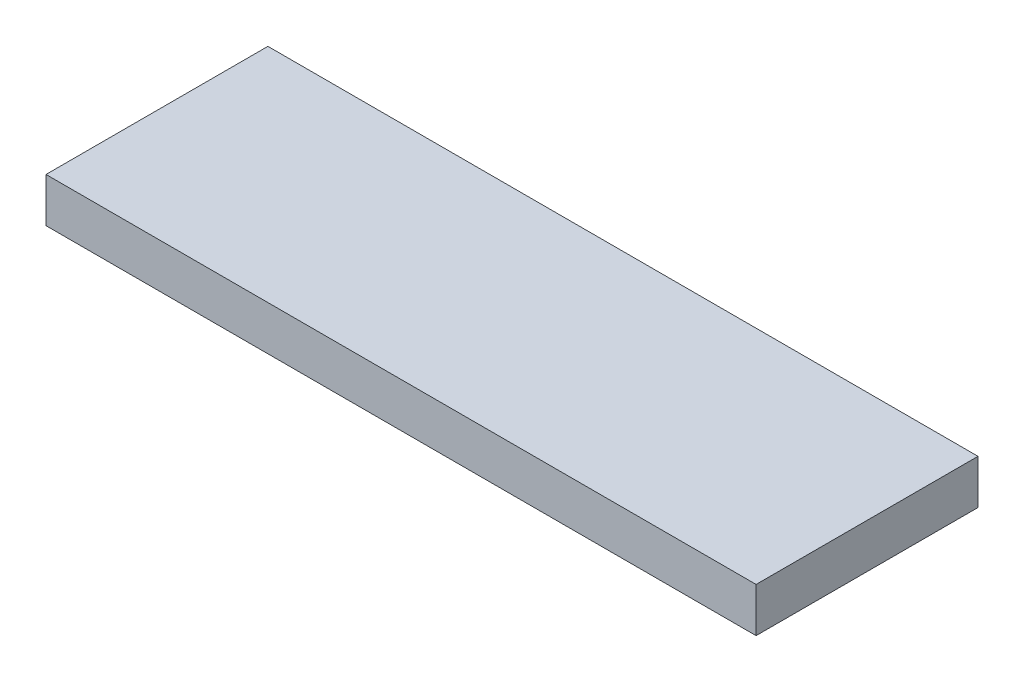
ISO-10303-21;
HEADER;
FILE_DESCRIPTION(('STEP AP214'),'2;1');
FILE_NAME('part.step','',(''),(''),'','','');
FILE_SCHEMA(('AUTOMOTIVE_DESIGN { 1 0 10303 214 1 1 1 1 }'));
ENDSEC;
DATA;
#1=APPLICATION_CONTEXT('core data for automotive mechanical design processes');
#2=APPLICATION_PROTOCOL_DEFINITION('international standard','automotive_design',2000,#1);
#3=PRODUCT_CONTEXT('',#1,'mechanical');
#4=PRODUCT('Part','Part','',(#3));
#5=PRODUCT_RELATED_PRODUCT_CATEGORY('part','',(#4));
#6=PRODUCT_DEFINITION_FORMATION('','',#4);
#7=PRODUCT_DEFINITION_CONTEXT('part definition',#1,'design');
#8=PRODUCT_DEFINITION('design','',#6,#7);
#9=PRODUCT_DEFINITION_SHAPE('','',#8);
#10=(LENGTH_UNIT() NAMED_UNIT(*) SI_UNIT(.MILLI.,.METRE.));
#11=(NAMED_UNIT(*) PLANE_ANGLE_UNIT() SI_UNIT($,.RADIAN.));
#12=(NAMED_UNIT(*) SI_UNIT($,.STERADIAN.) SOLID_ANGLE_UNIT());
#13=UNCERTAINTY_MEASURE_WITH_UNIT(LENGTH_MEASURE(1.E-05),#10,'distance_accuracy_value','');
#14=(GEOMETRIC_REPRESENTATION_CONTEXT(3) GLOBAL_UNCERTAINTY_ASSIGNED_CONTEXT((#13)) GLOBAL_UNIT_ASSIGNED_CONTEXT((#10,
#11,#12)) REPRESENTATION_CONTEXT('',''));
#15=CARTESIAN_POINT('',(0.,0.,0.));
#16=DIRECTION('',(0.,0.,1.));
#17=DIRECTION('',(1.,0.,0.));
#18=AXIS2_PLACEMENT_3D('',#15,#16,#17);
#19=CARTESIAN_POINT('',(0.,10.,0.));
#20=DIRECTION('',(0.,1.,0.));
#21=DIRECTION('',(0.,0.,1.));
#22=AXIS2_PLACEMENT_3D('',#19,#20,#21);
#23=PLANE('',#22);
#24=DIRECTION('',(-1.,0.,0.));
#25=VECTOR('',#24,1.);
#26=CARTESIAN_POINT('',(80.,10.,-25.));
#27=LINE('',#26,#25);
#28=CARTESIAN_POINT('',(-80.,10.,-25.));
#29=VERTEX_POINT('',#28);
#30=CARTESIAN_POINT('',(80.,10.,-25.));
#31=VERTEX_POINT('',#30);
#32=EDGE_CURVE('E68',#29,#31,#27,.F.);
#33=ORIENTED_EDGE('',*,*,#32,.F.);
#34=DIRECTION('',(0.,0.,1.));
#35=VECTOR('',#34,1.);
#36=CARTESIAN_POINT('',(-80.,10.,-25.));
#37=LINE('',#36,#35);
#38=CARTESIAN_POINT('',(-80.,10.,25.));
#39=VERTEX_POINT('',#38);
#40=EDGE_CURVE('E20',#39,#29,#37,.F.);
#41=ORIENTED_EDGE('',*,*,#40,.F.);
#42=DIRECTION('',(1.,0.,0.));
#43=VECTOR('',#42,1.);
#44=CARTESIAN_POINT('',(-80.,10.,25.));
#45=LINE('',#44,#43);
#46=CARTESIAN_POINT('',(80.,10.,25.));
#47=VERTEX_POINT('',#46);
#48=EDGE_CURVE('E58',#47,#39,#45,.F.);
#49=ORIENTED_EDGE('',*,*,#48,.F.);
#50=DIRECTION('',(0.,0.,-1.));
#51=VECTOR('',#50,1.);
#52=CARTESIAN_POINT('',(80.,10.,25.));
#53=LINE('',#52,#51);
#54=EDGE_CURVE('E53',#31,#47,#53,.F.);
#55=ORIENTED_EDGE('',*,*,#54,.F.);
#56=EDGE_LOOP('',(#33,#41,#49,#55));
#57=FACE_BOUND('',#56,.T.);
#58=ADVANCED_FACE('F17',(#57),#23,.T.);
#59=CARTESIAN_POINT('',(-80.,0.,-25.));
#60=DIRECTION('',(-1.,0.,0.));
#61=DIRECTION('',(0.,0.,1.));
#62=AXIS2_PLACEMENT_3D('',#59,#60,#61);
#63=PLANE('',#62);
#64=DIRECTION('',(0.,1.,0.));
#65=VECTOR('',#64,1.);
#66=CARTESIAN_POINT('',(-80.,0.,-25.));
#67=LINE('',#66,#65);
#68=CARTESIAN_POINT('',(-80.,0.,-25.));
#69=VERTEX_POINT('',#68);
#70=EDGE_CURVE('E79',#69,#29,#67,.T.);
#71=ORIENTED_EDGE('',*,*,#70,.F.);
#72=DIRECTION('',(0.,0.,1.));
#73=VECTOR('',#72,1.);
#74=CARTESIAN_POINT('',(-80.,0.,0.));
#75=LINE('',#74,#73);
#76=CARTESIAN_POINT('',(-80.,0.,25.));
#77=VERTEX_POINT('',#76);
#78=EDGE_CURVE('E74',#69,#77,#75,.T.);
#79=ORIENTED_EDGE('',*,*,#78,.T.);
#80=DIRECTION('',(0.,1.,0.));
#81=VECTOR('',#80,1.);
#82=CARTESIAN_POINT('',(-80.,0.,25.));
#83=LINE('',#82,#81);
#84=EDGE_CURVE('E63',#39,#77,#83,.F.);
#85=ORIENTED_EDGE('',*,*,#84,.F.);
#86=ORIENTED_EDGE('',*,*,#40,.T.);
#87=EDGE_LOOP('',(#71,#79,#85,#86));
#88=FACE_BOUND('',#87,.T.);
#89=ADVANCED_FACE('F73',(#88),#63,.T.);
#90=CARTESIAN_POINT('',(-80.,0.,25.));
#91=DIRECTION('',(0.,0.,1.));
#92=DIRECTION('',(1.,0.,0.));
#93=AXIS2_PLACEMENT_3D('',#90,#91,#92);
#94=PLANE('',#93);
#95=ORIENTED_EDGE('',*,*,#84,.T.);
#96=DIRECTION('',(1.,0.,0.));
#97=VECTOR('',#96,1.);
#98=CARTESIAN_POINT('',(0.,0.,25.));
#99=LINE('',#98,#97);
#100=CARTESIAN_POINT('',(80.,0.,25.));
#101=VERTEX_POINT('',#100);
#102=EDGE_CURVE('E84',#77,#101,#99,.T.);
#103=ORIENTED_EDGE('',*,*,#102,.T.);
#104=DIRECTION('',(0.,1.,0.));
#105=VECTOR('',#104,1.);
#106=CARTESIAN_POINT('',(80.,0.,25.));
#107=LINE('',#106,#105);
#108=EDGE_CURVE('E65',#47,#101,#107,.F.);
#109=ORIENTED_EDGE('',*,*,#108,.F.);
#110=ORIENTED_EDGE('',*,*,#48,.T.);
#111=EDGE_LOOP('',(#95,#103,#109,#110));
#112=FACE_BOUND('',#111,.T.);
#113=ADVANCED_FACE('F60',(#112),#94,.T.);
#114=CARTESIAN_POINT('',(80.,0.,25.));
#115=DIRECTION('',(1.,0.,0.));
#116=DIRECTION('',(0.,0.,-1.));
#117=AXIS2_PLACEMENT_3D('',#114,#115,#116);
#118=PLANE('',#117);
#119=ORIENTED_EDGE('',*,*,#108,.T.);
#120=DIRECTION('',(0.,0.,1.));
#121=VECTOR('',#120,1.);
#122=CARTESIAN_POINT('',(80.,0.,0.));
#123=LINE('',#122,#121);
#124=CARTESIAN_POINT('',(80.,0.,-25.));
#125=VERTEX_POINT('',#124);
#126=EDGE_CURVE('E26',#101,#125,#123,.F.);
#127=ORIENTED_EDGE('',*,*,#126,.T.);
#128=DIRECTION('',(0.,1.,0.));
#129=VECTOR('',#128,1.);
#130=CARTESIAN_POINT('',(80.,0.,-25.));
#131=LINE('',#130,#129);
#132=EDGE_CURVE('E34',#31,#125,#131,.F.);
#133=ORIENTED_EDGE('',*,*,#132,.F.);
#134=ORIENTED_EDGE('',*,*,#54,.T.);
#135=EDGE_LOOP('',(#119,#127,#133,#134));
#136=FACE_BOUND('',#135,.T.);
#137=ADVANCED_FACE('F88',(#136),#118,.T.);
#138=CARTESIAN_POINT('',(80.,0.,-25.));
#139=DIRECTION('',(0.,0.,-1.));
#140=DIRECTION('',(-1.,0.,0.));
#141=AXIS2_PLACEMENT_3D('',#138,#139,#140);
#142=PLANE('',#141);
#143=ORIENTED_EDGE('',*,*,#132,.T.);
#144=DIRECTION('',(1.,0.,0.));
#145=VECTOR('',#144,1.);
#146=CARTESIAN_POINT('',(0.,0.,-25.));
#147=LINE('',#146,#145);
#148=EDGE_CURVE('E11',#125,#69,#147,.F.);
#149=ORIENTED_EDGE('',*,*,#148,.T.);
#150=ORIENTED_EDGE('',*,*,#70,.T.);
#151=ORIENTED_EDGE('',*,*,#32,.T.);
#152=EDGE_LOOP('',(#143,#149,#150,#151));
#153=FACE_BOUND('',#152,.T.);
#154=ADVANCED_FACE('F91',(#153),#142,.T.);
#155=CARTESIAN_POINT('',(0.,0.,0.));
#156=DIRECTION('',(0.,1.,0.));
#157=DIRECTION('',(0.,0.,1.));
#158=AXIS2_PLACEMENT_3D('',#155,#156,#157);
#159=PLANE('',#158);
#160=ORIENTED_EDGE('',*,*,#126,.F.);
#161=ORIENTED_EDGE('',*,*,#102,.F.);
#162=ORIENTED_EDGE('',*,*,#78,.F.);
#163=ORIENTED_EDGE('',*,*,#148,.F.);
#164=EDGE_LOOP('',(#160,#161,#162,#163));
#165=FACE_BOUND('',#164,.T.);
#166=ADVANCED_FACE('F90',(#165),#159,.F.);
#167=CLOSED_SHELL('',(#58,#89,#113,#137,#154,#166));
#168=MANIFOLD_SOLID_BREP('B1',#167);
#169=ADVANCED_BREP_SHAPE_REPRESENTATION('',(#18,#168),#14);
#170=SHAPE_DEFINITION_REPRESENTATION(#9,#169);
ENDSEC;
END-ISO-10303-21;
